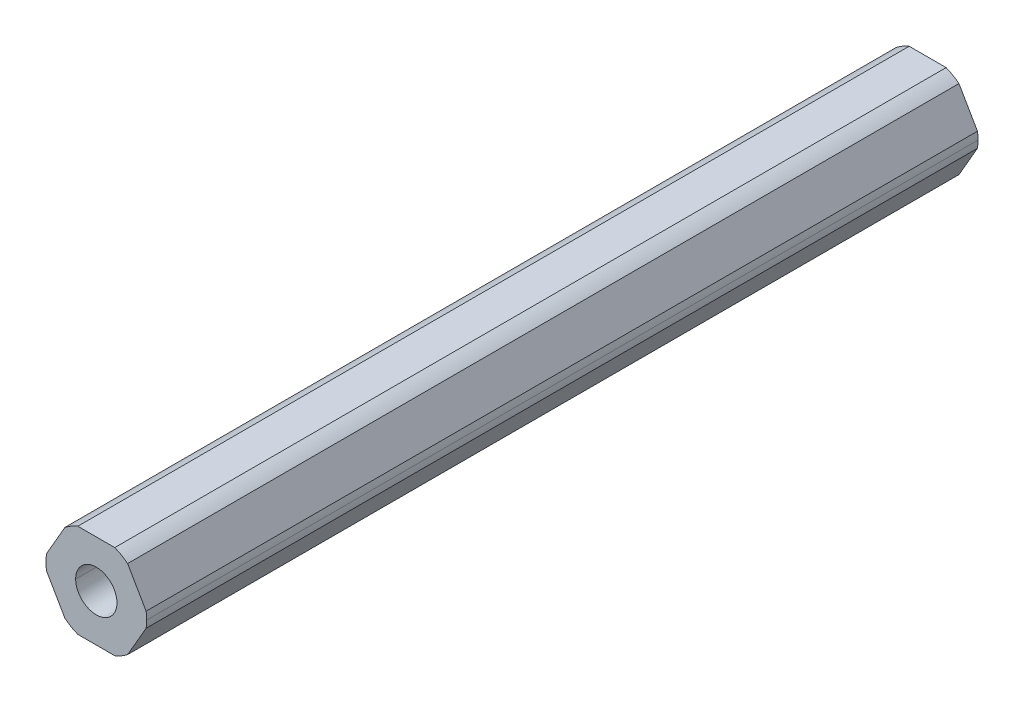
ISO-10303-21;
HEADER;
FILE_DESCRIPTION(('STEP AP214'),'2;1');
FILE_NAME('part.step','',(''),(''),'','','');
FILE_SCHEMA(('AUTOMOTIVE_DESIGN { 1 0 10303 214 1 1 1 1 }'));
ENDSEC;
DATA;
#1=APPLICATION_CONTEXT('core data for automotive mechanical design processes');
#2=APPLICATION_PROTOCOL_DEFINITION('international standard','automotive_design',2000,#1);
#3=PRODUCT_CONTEXT('',#1,'mechanical');
#4=PRODUCT('Part','Part','',(#3));
#5=PRODUCT_RELATED_PRODUCT_CATEGORY('part','',(#4));
#6=PRODUCT_DEFINITION_FORMATION('','',#4);
#7=PRODUCT_DEFINITION_CONTEXT('part definition',#1,'design');
#8=PRODUCT_DEFINITION('design','',#6,#7);
#9=PRODUCT_DEFINITION_SHAPE('','',#8);
#10=(LENGTH_UNIT() NAMED_UNIT(*) SI_UNIT(.MILLI.,.METRE.));
#11=(NAMED_UNIT(*) PLANE_ANGLE_UNIT() SI_UNIT($,.RADIAN.));
#12=(NAMED_UNIT(*) SI_UNIT($,.STERADIAN.) SOLID_ANGLE_UNIT());
#13=UNCERTAINTY_MEASURE_WITH_UNIT(LENGTH_MEASURE(1.E-05),#10,'distance_accuracy_value','');
#14=(GEOMETRIC_REPRESENTATION_CONTEXT(3) GLOBAL_UNCERTAINTY_ASSIGNED_CONTEXT((#13)) GLOBAL_UNIT_ASSIGNED_CONTEXT((#10,
#11,#12)) REPRESENTATION_CONTEXT('',''));
#15=CARTESIAN_POINT('',(0.,0.,0.));
#16=DIRECTION('',(0.,0.,1.));
#17=DIRECTION('',(1.,0.,0.));
#18=AXIS2_PLACEMENT_3D('',#15,#16,#17);
#19=CARTESIAN_POINT('',(0.,0.,-457.2));
#20=DIRECTION('',(0.,0.,1.));
#21=DIRECTION('',(1.,0.,0.));
#22=AXIS2_PLACEMENT_3D('',#19,#20,#21);
#23=CYLINDRICAL_SURFACE('',#22,2.1);
#24=DIRECTION('',(0.,0.,1.));
#25=VECTOR('',#24,1.);
#26=CARTESIAN_POINT('',(-2.1,0.,-457.2));
#27=LINE('',#26,#25);
#28=CARTESIAN_POINT('',(-2.1,0.,-457.2));
#29=VERTEX_POINT('',#28);
#30=CARTESIAN_POINT('',(-2.1,0.,-372.6764));
#31=VERTEX_POINT('',#30);
#32=EDGE_CURVE('E52',#29,#31,#27,.T.);
#33=ORIENTED_EDGE('',*,*,#32,.T.);
#34=CARTESIAN_POINT('',(0.,0.,-372.6764));
#35=DIRECTION('',(0.,0.,-1.));
#36=DIRECTION('',(-1.,0.,0.));
#37=AXIS2_PLACEMENT_3D('',#34,#35,#36);
#38=CIRCLE('',#37,2.1);
#39=CARTESIAN_POINT('',(2.1,0.,-372.6764));
#40=VERTEX_POINT('',#39);
#41=EDGE_CURVE('E66',#31,#40,#38,.F.);
#42=ORIENTED_EDGE('',*,*,#41,.T.);
#43=DIRECTION('',(0.,0.,1.));
#44=VECTOR('',#43,1.);
#45=CARTESIAN_POINT('',(2.1,0.,-457.2));
#46=LINE('',#45,#44);
#47=CARTESIAN_POINT('',(2.1,0.,-457.2));
#48=VERTEX_POINT('',#47);
#49=EDGE_CURVE('E232',#48,#40,#46,.T.);
#50=ORIENTED_EDGE('',*,*,#49,.F.);
#51=CARTESIAN_POINT('',(0.,0.,-457.2));
#52=DIRECTION('',(0.,0.,1.));
#53=DIRECTION('',(1.,0.,0.));
#54=AXIS2_PLACEMENT_3D('',#51,#52,#53);
#55=CIRCLE('',#54,2.1);
#56=EDGE_CURVE('E213',#29,#48,#55,.T.);
#57=ORIENTED_EDGE('',*,*,#56,.F.);
#58=EDGE_LOOP('',(#33,#42,#50,#57));
#59=FACE_BOUND('',#58,.T.);
#60=ADVANCED_FACE('F44',(#59),#23,.F.);
#61=CARTESIAN_POINT('',(0.,0.,-457.2));
#62=DIRECTION('',(0.,0.,1.));
#63=DIRECTION('',(1.,0.,0.));
#64=AXIS2_PLACEMENT_3D('',#61,#62,#63);
#65=CYLINDRICAL_SURFACE('',#64,5.12);
#66=CARTESIAN_POINT('',(0.,0.,-372.6764));
#67=DIRECTION('',(0.,0.,-1.));
#68=DIRECTION('',(-1.,0.,0.));
#69=AXIS2_PLACEMENT_3D('',#66,#67,#68);
#70=CIRCLE('',#69,5.12);
#71=CARTESIAN_POINT('',(5.06425896558911,-0.753446168913433,-372.6764));
#72=VERTEX_POINT('',#71);
#73=CARTESIAN_POINT('',(5.12,0.,-372.6764));
#74=VERTEX_POINT('',#73);
#75=EDGE_CURVE('E166',#72,#74,#70,.F.);
#76=ORIENTED_EDGE('',*,*,#75,.F.);
#77=DIRECTION('',(0.,0.,-1.));
#78=VECTOR('',#77,1.);
#79=CARTESIAN_POINT('',(5.06425896558911,-0.753446168913433,-457.2));
#80=LINE('',#79,#78);
#81=CARTESIAN_POINT('',(5.06425896558911,-0.753446168913433,-457.2));
#82=VERTEX_POINT('',#81);
#83=EDGE_CURVE('E179',#72,#82,#80,.T.);
#84=ORIENTED_EDGE('',*,*,#83,.T.);
#85=CARTESIAN_POINT('',(0.,0.,-457.2));
#86=DIRECTION('',(0.,0.,1.));
#87=DIRECTION('',(1.,0.,0.));
#88=AXIS2_PLACEMENT_3D('',#85,#86,#87);
#89=CIRCLE('',#88,5.12);
#90=CARTESIAN_POINT('',(5.12,0.,-457.2));
#91=VERTEX_POINT('',#90);
#92=EDGE_CURVE('E189',#82,#91,#89,.T.);
#93=ORIENTED_EDGE('',*,*,#92,.T.);
#94=DIRECTION('',(0.,0.,1.));
#95=VECTOR('',#94,1.);
#96=CARTESIAN_POINT('',(5.12,0.,-457.2));
#97=LINE('',#96,#95);
#98=EDGE_CURVE('E181',#91,#74,#97,.T.);
#99=ORIENTED_EDGE('',*,*,#98,.T.);
#100=EDGE_LOOP('',(#76,#84,#93,#99));
#101=FACE_BOUND('',#100,.T.);
#102=ADVANCED_FACE('F177',(#101),#65,.T.);
#103=CARTESIAN_POINT('',(2.74963065701564,-4.7625,457.2));
#104=DIRECTION('',(-0.866025403784442,0.5,0.));
#105=DIRECTION('',(0.,0.,1.));
#106=AXIS2_PLACEMENT_3D('',#103,#104,#105);
#107=PLANE('',#106);
#108=ORIENTED_EDGE('',*,*,#83,.F.);
#109=DIRECTION('',(0.499999999999991,0.866025403784444,0.));
#110=VECTOR('',#109,1.);
#111=CARTESIAN_POINT('',(3.18463300545771,-4.00905383108654,-372.6764));
#112=LINE('',#111,#110);
#113=CARTESIAN_POINT('',(3.18463300545771,-4.00905383108654,-372.6764));
#114=VERTEX_POINT('',#113);
#115=EDGE_CURVE('E163',#114,#72,#112,.T.);
#116=ORIENTED_EDGE('',*,*,#115,.F.);
#117=DIRECTION('',(0.,0.,1.));
#118=VECTOR('',#117,1.);
#119=CARTESIAN_POINT('',(3.1846330054577,-4.00905383108652,-457.2));
#120=LINE('',#119,#118);
#121=CARTESIAN_POINT('',(3.1846330054577,-4.00905383108652,-457.2));
#122=VERTEX_POINT('',#121);
#123=EDGE_CURVE('E218',#122,#114,#120,.T.);
#124=ORIENTED_EDGE('',*,*,#123,.F.);
#125=DIRECTION('',(0.5,0.866025403784442,0.));
#126=VECTOR('',#125,1.);
#127=CARTESIAN_POINT('',(2.74963065701564,-4.7625,-457.2));
#128=LINE('',#127,#126);
#129=EDGE_CURVE('E186',#122,#82,#128,.T.);
#130=ORIENTED_EDGE('',*,*,#129,.T.);
#131=EDGE_LOOP('',(#108,#116,#124,#130));
#132=FACE_BOUND('',#131,.T.);
#133=ADVANCED_FACE('F184',(#132),#107,.F.);
#134=CARTESIAN_POINT('',(5.49926131403117,0.,457.2));
#135=DIRECTION('',(-0.866025403784438,-0.5,0.));
#136=DIRECTION('',(-0.5,0.866025403784438,0.));
#137=AXIS2_PLACEMENT_3D('',#134,#135,#136);
#138=PLANE('',#137);
#139=DIRECTION('',(0.,0.,-1.));
#140=VECTOR('',#139,1.);
#141=CARTESIAN_POINT('',(3.18463300545762,4.00905383108658,-457.2));
#142=LINE('',#141,#140);
#143=CARTESIAN_POINT('',(3.18463300545762,4.00905383108658,-372.6764));
#144=VERTEX_POINT('',#143);
#145=CARTESIAN_POINT('',(3.18463300545762,4.00905383108658,-457.2));
#146=VERTEX_POINT('',#145);
#147=EDGE_CURVE('E222',#144,#146,#142,.T.);
#148=ORIENTED_EDGE('',*,*,#147,.F.);
#149=DIRECTION('',(-0.500000000000001,0.866025403784438,0.));
#150=VECTOR('',#149,1.);
#151=CARTESIAN_POINT('',(5.06425896558911,0.753446168913416,-372.6764));
#152=LINE('',#151,#150);
#153=CARTESIAN_POINT('',(5.06425896558911,0.753446168913416,-372.6764));
#154=VERTEX_POINT('',#153);
#155=EDGE_CURVE('E59',#154,#144,#152,.T.);
#156=ORIENTED_EDGE('',*,*,#155,.F.);
#157=DIRECTION('',(0.,0.,1.));
#158=VECTOR('',#157,1.);
#159=CARTESIAN_POINT('',(5.06425896558911,0.753446168913412,-457.2));
#160=LINE('',#159,#158);
#161=CARTESIAN_POINT('',(5.06425896558911,0.753446168913416,-457.2));
#162=VERTEX_POINT('',#161);
#163=EDGE_CURVE('E214',#162,#154,#160,.T.);
#164=ORIENTED_EDGE('',*,*,#163,.F.);
#165=DIRECTION('',(-0.5,0.866025403784438,0.));
#166=VECTOR('',#165,1.);
#167=CARTESIAN_POINT('',(5.49926131403117,0.,-457.2));
#168=LINE('',#167,#166);
#169=EDGE_CURVE('E192',#162,#146,#168,.T.);
#170=ORIENTED_EDGE('',*,*,#169,.T.);
#171=EDGE_LOOP('',(#148,#156,#164,#170));
#172=FACE_BOUND('',#171,.T.);
#173=ADVANCED_FACE('F305',(#172),#138,.F.);
#174=CARTESIAN_POINT('',(2.74963065701557,4.7625,457.2));
#175=DIRECTION('',(0.,-1.,0.));
#176=DIRECTION('',(0.,0.,-1.));
#177=AXIS2_PLACEMENT_3D('',#174,#175,#176);
#178=PLANE('',#177);
#179=DIRECTION('',(0.,0.,-1.));
#180=VECTOR('',#179,1.);
#181=CARTESIAN_POINT('',(-1.8796259601315,4.7625,-457.2));
#182=LINE('',#181,#180);
#183=CARTESIAN_POINT('',(-1.8796259601315,4.7625,-372.6764));
#184=VERTEX_POINT('',#183);
#185=CARTESIAN_POINT('',(-1.8796259601315,4.7625,-457.2));
#186=VERTEX_POINT('',#185);
#187=EDGE_CURVE('E196',#184,#186,#182,.T.);
#188=ORIENTED_EDGE('',*,*,#187,.F.);
#189=DIRECTION('',(-1.,0.,0.));
#190=VECTOR('',#189,1.);
#191=CARTESIAN_POINT('',(1.87962596013146,4.76249999999999,-372.6764));
#192=LINE('',#191,#190);
#193=CARTESIAN_POINT('',(1.87962596013146,4.76249999999999,-372.6764));
#194=VERTEX_POINT('',#193);
#195=EDGE_CURVE('E308',#194,#184,#192,.T.);
#196=ORIENTED_EDGE('',*,*,#195,.F.);
#197=DIRECTION('',(0.,0.,1.));
#198=VECTOR('',#197,1.);
#199=CARTESIAN_POINT('',(1.87962596013147,4.7625,-457.2));
#200=LINE('',#199,#198);
#201=CARTESIAN_POINT('',(1.87962596013147,4.7625,-457.2));
#202=VERTEX_POINT('',#201);
#203=EDGE_CURVE('E223',#202,#194,#200,.T.);
#204=ORIENTED_EDGE('',*,*,#203,.F.);
#205=DIRECTION('',(-1.,0.,0.));
#206=VECTOR('',#205,1.);
#207=CARTESIAN_POINT('',(2.74963065701557,4.7625,-457.2));
#208=LINE('',#207,#206);
#209=EDGE_CURVE('E202',#202,#186,#208,.T.);
#210=ORIENTED_EDGE('',*,*,#209,.T.);
#211=EDGE_LOOP('',(#188,#196,#204,#210));
#212=FACE_BOUND('',#211,.T.);
#213=ADVANCED_FACE('F348',(#212),#178,.F.);
#214=CARTESIAN_POINT('',(-2.7496306570156,4.7625,457.2));
#215=DIRECTION('',(0.866025403784442,-0.5,0.));
#216=DIRECTION('',(0.,0.,-1.));
#217=AXIS2_PLACEMENT_3D('',#214,#215,#216);
#218=PLANE('',#217);
#219=DIRECTION('',(0.,0.,-1.));
#220=VECTOR('',#219,1.);
#221=CARTESIAN_POINT('',(-5.06425896558912,0.753446168913382,-457.2));
#222=LINE('',#221,#220);
#223=CARTESIAN_POINT('',(-5.06425896558912,0.753446168913382,-372.6764));
#224=VERTEX_POINT('',#223);
#225=CARTESIAN_POINT('',(-5.06425896558912,0.753446168913382,-457.2));
#226=VERTEX_POINT('',#225);
#227=EDGE_CURVE('E204',#224,#226,#222,.T.);
#228=ORIENTED_EDGE('',*,*,#227,.F.);
#229=DIRECTION('',(-0.499999999999993,-0.866025403784443,0.));
#230=VECTOR('',#229,1.);
#231=CARTESIAN_POINT('',(-3.18463300545766,4.00905383108656,-372.6764));
#232=LINE('',#231,#230);
#233=CARTESIAN_POINT('',(-3.18463300545767,4.00905383108657,-372.6764));
#234=VERTEX_POINT('',#233);
#235=EDGE_CURVE('E320',#234,#224,#232,.T.);
#236=ORIENTED_EDGE('',*,*,#235,.F.);
#237=DIRECTION('',(0.,0.,1.));
#238=VECTOR('',#237,1.);
#239=CARTESIAN_POINT('',(-3.18463300545766,4.00905383108655,-457.2));
#240=LINE('',#239,#238);
#241=CARTESIAN_POINT('',(-3.18463300545766,4.00905383108655,-457.2));
#242=VERTEX_POINT('',#241);
#243=EDGE_CURVE('E229',#242,#234,#240,.T.);
#244=ORIENTED_EDGE('',*,*,#243,.F.);
#245=DIRECTION('',(-0.5,-0.866025403784442,0.));
#246=VECTOR('',#245,1.);
#247=CARTESIAN_POINT('',(-2.7496306570156,4.7625,-457.2));
#248=LINE('',#247,#246);
#249=EDGE_CURVE('E198',#242,#226,#248,.T.);
#250=ORIENTED_EDGE('',*,*,#249,.T.);
#251=EDGE_LOOP('',(#228,#236,#244,#250));
#252=FACE_BOUND('',#251,.T.);
#253=ADVANCED_FACE('F357',(#252),#218,.F.);
#254=CARTESIAN_POINT('',(-5.49926131403117,0.,457.2));
#255=DIRECTION('',(0.866025403784435,0.500000000000007,0.));
#256=DIRECTION('',(0.,0.,-1.));
#257=AXIS2_PLACEMENT_3D('',#254,#255,#256);
#258=PLANE('',#257);
#259=DIRECTION('',(0.,0.,-1.));
#260=VECTOR('',#259,1.);
#261=CARTESIAN_POINT('',(-3.1846330054576,-4.0090538310866,-457.2));
#262=LINE('',#261,#260);
#263=CARTESIAN_POINT('',(-3.1846330054576,-4.0090538310866,-372.6764));
#264=VERTEX_POINT('',#263);
#265=CARTESIAN_POINT('',(-3.1846330054576,-4.0090538310866,-457.2));
#266=VERTEX_POINT('',#265);
#267=EDGE_CURVE('E242',#264,#266,#262,.T.);
#268=ORIENTED_EDGE('',*,*,#267,.F.);
#269=DIRECTION('',(0.500000000000007,-0.866025403784435,0.));
#270=VECTOR('',#269,1.);
#271=CARTESIAN_POINT('',(-5.06425896558911,-0.753446168913448,-372.6764));
#272=LINE('',#271,#270);
#273=CARTESIAN_POINT('',(-5.06425896558911,-0.753446168913446,-372.6764));
#274=VERTEX_POINT('',#273);
#275=EDGE_CURVE('E316',#274,#264,#272,.T.);
#276=ORIENTED_EDGE('',*,*,#275,.F.);
#277=DIRECTION('',(0.,0.,1.));
#278=VECTOR('',#277,1.);
#279=CARTESIAN_POINT('',(-5.06425896558911,-0.75344616891345,-457.2));
#280=LINE('',#279,#278);
#281=CARTESIAN_POINT('',(-5.06425896558911,-0.75344616891345,-457.2));
#282=VERTEX_POINT('',#281);
#283=EDGE_CURVE('E255',#282,#274,#280,.T.);
#284=ORIENTED_EDGE('',*,*,#283,.F.);
#285=DIRECTION('',(0.500000000000007,-0.866025403784435,0.));
#286=VECTOR('',#285,1.);
#287=CARTESIAN_POINT('',(-5.49926131403117,0.,-457.2));
#288=LINE('',#287,#286);
#289=EDGE_CURVE('E203',#282,#266,#288,.T.);
#290=ORIENTED_EDGE('',*,*,#289,.T.);
#291=EDGE_LOOP('',(#268,#276,#284,#290));
#292=FACE_BOUND('',#291,.T.);
#293=ADVANCED_FACE('F337',(#292),#258,.F.);
#294=CARTESIAN_POINT('',(-2.74963065701554,-4.7625,457.2));
#295=DIRECTION('',(0.,1.,0.));
#296=DIRECTION('',(1.,0.,0.));
#297=AXIS2_PLACEMENT_3D('',#294,#295,#296);
#298=PLANE('',#297);
#299=DIRECTION('',(0.,0.,-1.));
#300=VECTOR('',#299,1.);
#301=CARTESIAN_POINT('',(1.87962596013154,-4.7625,-457.2));
#302=LINE('',#301,#300);
#303=CARTESIAN_POINT('',(1.87962596013153,-4.7625,-372.6764));
#304=VERTEX_POINT('',#303);
#305=CARTESIAN_POINT('',(1.87962596013154,-4.7625,-457.2));
#306=VERTEX_POINT('',#305);
#307=EDGE_CURVE('E257',#304,#306,#302,.T.);
#308=ORIENTED_EDGE('',*,*,#307,.F.);
#309=DIRECTION('',(1.,0.,0.));
#310=VECTOR('',#309,1.);
#311=CARTESIAN_POINT('',(-1.87962596013144,-4.7625,-372.6764));
#312=LINE('',#311,#310);
#313=CARTESIAN_POINT('',(-1.87962596013144,-4.7625,-372.6764));
#314=VERTEX_POINT('',#313);
#315=EDGE_CURVE('E312',#314,#304,#312,.T.);
#316=ORIENTED_EDGE('',*,*,#315,.F.);
#317=DIRECTION('',(0.,0.,1.));
#318=VECTOR('',#317,1.);
#319=CARTESIAN_POINT('',(-1.87962596013144,-4.7625,-457.2));
#320=LINE('',#319,#318);
#321=CARTESIAN_POINT('',(-1.87962596013144,-4.7625,-457.2));
#322=VERTEX_POINT('',#321);
#323=EDGE_CURVE('E206',#322,#314,#320,.T.);
#324=ORIENTED_EDGE('',*,*,#323,.F.);
#325=DIRECTION('',(1.,0.,0.));
#326=VECTOR('',#325,1.);
#327=CARTESIAN_POINT('',(-2.74963065701554,-4.7625,-457.2));
#328=LINE('',#327,#326);
#329=EDGE_CURVE('E212',#322,#306,#328,.T.);
#330=ORIENTED_EDGE('',*,*,#329,.T.);
#331=EDGE_LOOP('',(#308,#316,#324,#330));
#332=FACE_BOUND('',#331,.T.);
#333=ADVANCED_FACE('F330',(#332),#298,.F.);
#334=CARTESIAN_POINT('',(0.,0.,-457.2));
#335=DIRECTION('',(0.,0.,1.));
#336=DIRECTION('',(1.,0.,0.));
#337=AXIS2_PLACEMENT_3D('',#334,#335,#336);
#338=PLANE('',#337);
#339=CARTESIAN_POINT('',(0.,0.,-457.2));
#340=DIRECTION('',(0.,0.,1.));
#341=DIRECTION('',(1.,0.,0.));
#342=AXIS2_PLACEMENT_3D('',#339,#340,#341);
#343=CIRCLE('',#342,5.12);
#344=EDGE_CURVE('E219',#146,#202,#343,.T.);
#345=ORIENTED_EDGE('',*,*,#344,.F.);
#346=ORIENTED_EDGE('',*,*,#169,.F.);
#347=CARTESIAN_POINT('',(0.,0.,-457.2));
#348=DIRECTION('',(0.,0.,1.));
#349=DIRECTION('',(1.,0.,0.));
#350=AXIS2_PLACEMENT_3D('',#347,#348,#349);
#351=CIRCLE('',#350,5.12);
#352=EDGE_CURVE('E217',#91,#162,#351,.T.);
#353=ORIENTED_EDGE('',*,*,#352,.F.);
#354=ORIENTED_EDGE('',*,*,#92,.F.);
#355=ORIENTED_EDGE('',*,*,#129,.F.);
#356=CARTESIAN_POINT('',(0.,0.,-457.2));
#357=DIRECTION('',(0.,0.,1.));
#358=DIRECTION('',(1.,0.,0.));
#359=AXIS2_PLACEMENT_3D('',#356,#357,#358);
#360=CIRCLE('',#359,5.12);
#361=EDGE_CURVE('E243',#306,#122,#360,.T.);
#362=ORIENTED_EDGE('',*,*,#361,.F.);
#363=ORIENTED_EDGE('',*,*,#329,.F.);
#364=CARTESIAN_POINT('',(0.,0.,-457.2));
#365=DIRECTION('',(0.,0.,1.));
#366=DIRECTION('',(1.,0.,0.));
#367=AXIS2_PLACEMENT_3D('',#364,#365,#366);
#368=CIRCLE('',#367,5.12);
#369=EDGE_CURVE('E244',#266,#322,#368,.T.);
#370=ORIENTED_EDGE('',*,*,#369,.F.);
#371=ORIENTED_EDGE('',*,*,#289,.F.);
#372=CARTESIAN_POINT('',(0.,0.,-457.2));
#373=DIRECTION('',(0.,0.,1.));
#374=DIRECTION('',(1.,0.,0.));
#375=AXIS2_PLACEMENT_3D('',#372,#373,#374);
#376=CIRCLE('',#375,5.12);
#377=EDGE_CURVE('E207',#226,#282,#376,.T.);
#378=ORIENTED_EDGE('',*,*,#377,.F.);
#379=ORIENTED_EDGE('',*,*,#249,.F.);
#380=CARTESIAN_POINT('',(0.,0.,-457.2));
#381=DIRECTION('',(0.,0.,1.));
#382=DIRECTION('',(1.,0.,0.));
#383=AXIS2_PLACEMENT_3D('',#380,#381,#382);
#384=CIRCLE('',#383,5.12);
#385=EDGE_CURVE('E249',#186,#242,#384,.T.);
#386=ORIENTED_EDGE('',*,*,#385,.F.);
#387=ORIENTED_EDGE('',*,*,#209,.F.);
#388=EDGE_LOOP('',(#345,#346,#353,#354,#355,#362,#363,#370,#371,#378,#379,#386,#387));
#389=FACE_BOUND('',#388,.T.);
#390=CARTESIAN_POINT('',(0.,0.,-457.2));
#391=DIRECTION('',(0.,0.,1.));
#392=DIRECTION('',(1.,0.,0.));
#393=AXIS2_PLACEMENT_3D('',#390,#391,#392);
#394=CIRCLE('',#393,2.1);
#395=EDGE_CURVE('E208',#48,#29,#394,.T.);
#396=ORIENTED_EDGE('',*,*,#395,.T.);
#397=ORIENTED_EDGE('',*,*,#56,.T.);
#398=EDGE_LOOP('',(#396,#397));
#399=FACE_BOUND('',#398,.T.);
#400=ADVANCED_FACE('F46',(#389,#399),#338,.F.);
#401=CARTESIAN_POINT('',(0.,0.,-457.2));
#402=DIRECTION('',(0.,0.,1.));
#403=DIRECTION('',(1.,0.,0.));
#404=AXIS2_PLACEMENT_3D('',#401,#402,#403);
#405=CYLINDRICAL_SURFACE('',#404,5.12);
#406=EDGE_CURVE('E173',#74,#154,#70,.F.);
#407=ORIENTED_EDGE('',*,*,#406,.F.);
#408=ORIENTED_EDGE('',*,*,#98,.F.);
#409=ORIENTED_EDGE('',*,*,#352,.T.);
#410=ORIENTED_EDGE('',*,*,#163,.T.);
#411=EDGE_LOOP('',(#407,#408,#409,#410));
#412=FACE_BOUND('',#411,.T.);
#413=ADVANCED_FACE('F295',(#412),#405,.T.);
#414=CARTESIAN_POINT('',(0.,0.,-457.2));
#415=DIRECTION('',(0.,0.,1.));
#416=DIRECTION('',(1.,0.,0.));
#417=AXIS2_PLACEMENT_3D('',#414,#415,#416);
#418=CYLINDRICAL_SURFACE('',#417,5.12);
#419=CARTESIAN_POINT('',(0.,0.,-372.6764));
#420=DIRECTION('',(0.,0.,-1.));
#421=DIRECTION('',(-1.,0.,0.));
#422=AXIS2_PLACEMENT_3D('',#419,#420,#421);
#423=CIRCLE('',#422,5.12000000000003);
#424=EDGE_CURVE('E169',#304,#114,#423,.F.);
#425=ORIENTED_EDGE('',*,*,#424,.F.);
#426=ORIENTED_EDGE('',*,*,#307,.T.);
#427=ORIENTED_EDGE('',*,*,#361,.T.);
#428=ORIENTED_EDGE('',*,*,#123,.T.);
#429=EDGE_LOOP('',(#425,#426,#427,#428));
#430=FACE_BOUND('',#429,.T.);
#431=ADVANCED_FACE('F335',(#430),#418,.T.);
#432=CARTESIAN_POINT('',(0.,0.,-457.2));
#433=DIRECTION('',(0.,0.,1.));
#434=DIRECTION('',(1.,0.,0.));
#435=AXIS2_PLACEMENT_3D('',#432,#433,#434);
#436=CYLINDRICAL_SURFACE('',#435,5.12);
#437=CARTESIAN_POINT('',(0.,0.,-372.6764));
#438=DIRECTION('',(0.,0.,-1.));
#439=DIRECTION('',(-1.,0.,0.));
#440=AXIS2_PLACEMENT_3D('',#437,#438,#439);
#441=CIRCLE('',#440,5.12);
#442=EDGE_CURVE('E314',#264,#314,#441,.F.);
#443=ORIENTED_EDGE('',*,*,#442,.F.);
#444=ORIENTED_EDGE('',*,*,#267,.T.);
#445=ORIENTED_EDGE('',*,*,#369,.T.);
#446=ORIENTED_EDGE('',*,*,#323,.T.);
#447=EDGE_LOOP('',(#443,#444,#445,#446));
#448=FACE_BOUND('',#447,.T.);
#449=ADVANCED_FACE('F364',(#448),#436,.T.);
#450=CARTESIAN_POINT('',(0.,0.,-457.2));
#451=DIRECTION('',(0.,0.,1.));
#452=DIRECTION('',(1.,0.,0.));
#453=AXIS2_PLACEMENT_3D('',#450,#451,#452);
#454=CYLINDRICAL_SURFACE('',#453,5.12);
#455=CARTESIAN_POINT('',(0.,0.,-372.6764));
#456=DIRECTION('',(0.,0.,-1.));
#457=DIRECTION('',(-1.,0.,0.));
#458=AXIS2_PLACEMENT_3D('',#455,#456,#457);
#459=CIRCLE('',#458,5.12);
#460=EDGE_CURVE('E318',#224,#274,#459,.F.);
#461=ORIENTED_EDGE('',*,*,#460,.F.);
#462=ORIENTED_EDGE('',*,*,#227,.T.);
#463=ORIENTED_EDGE('',*,*,#377,.T.);
#464=ORIENTED_EDGE('',*,*,#283,.T.);
#465=EDGE_LOOP('',(#461,#462,#463,#464));
#466=FACE_BOUND('',#465,.T.);
#467=ADVANCED_FACE('F352',(#466),#454,.T.);
#468=CARTESIAN_POINT('',(0.,0.,-457.2));
#469=DIRECTION('',(0.,0.,1.));
#470=DIRECTION('',(1.,0.,0.));
#471=AXIS2_PLACEMENT_3D('',#468,#469,#470);
#472=CYLINDRICAL_SURFACE('',#471,5.12);
#473=CARTESIAN_POINT('',(0.,0.,-372.6764));
#474=DIRECTION('',(0.,0.,-1.));
#475=DIRECTION('',(-1.,0.,0.));
#476=AXIS2_PLACEMENT_3D('',#473,#474,#475);
#477=CIRCLE('',#476,5.12000000000002);
#478=EDGE_CURVE('E322',#184,#234,#477,.F.);
#479=ORIENTED_EDGE('',*,*,#478,.F.);
#480=ORIENTED_EDGE('',*,*,#187,.T.);
#481=ORIENTED_EDGE('',*,*,#385,.T.);
#482=ORIENTED_EDGE('',*,*,#243,.T.);
#483=EDGE_LOOP('',(#479,#480,#481,#482));
#484=FACE_BOUND('',#483,.T.);
#485=ADVANCED_FACE('F349',(#484),#472,.T.);
#486=CARTESIAN_POINT('',(0.,0.,-457.2));
#487=DIRECTION('',(0.,0.,1.));
#488=DIRECTION('',(1.,0.,0.));
#489=AXIS2_PLACEMENT_3D('',#486,#487,#488);
#490=CYLINDRICAL_SURFACE('',#489,5.12);
#491=CARTESIAN_POINT('',(0.,0.,-372.6764));
#492=DIRECTION('',(0.,0.,-1.));
#493=DIRECTION('',(-1.,0.,0.));
#494=AXIS2_PLACEMENT_3D('',#491,#492,#493);
#495=CIRCLE('',#494,5.12);
#496=EDGE_CURVE('E306',#144,#194,#495,.F.);
#497=ORIENTED_EDGE('',*,*,#496,.F.);
#498=ORIENTED_EDGE('',*,*,#147,.T.);
#499=ORIENTED_EDGE('',*,*,#344,.T.);
#500=ORIENTED_EDGE('',*,*,#203,.T.);
#501=EDGE_LOOP('',(#497,#498,#499,#500));
#502=FACE_BOUND('',#501,.T.);
#503=ADVANCED_FACE('F351',(#502),#490,.T.);
#504=CARTESIAN_POINT('',(0.,0.,-457.2));
#505=DIRECTION('',(0.,0.,1.));
#506=DIRECTION('',(1.,0.,0.));
#507=AXIS2_PLACEMENT_3D('',#504,#505,#506);
#508=CYLINDRICAL_SURFACE('',#507,2.1);
#509=ORIENTED_EDGE('',*,*,#49,.T.);
#510=CARTESIAN_POINT('',(0.,0.,-372.6764));
#511=DIRECTION('',(0.,0.,-1.));
#512=DIRECTION('',(-1.,0.,0.));
#513=AXIS2_PLACEMENT_3D('',#510,#511,#512);
#514=CIRCLE('',#513,2.1);
#515=EDGE_CURVE('E11',#40,#31,#514,.F.);
#516=ORIENTED_EDGE('',*,*,#515,.T.);
#517=ORIENTED_EDGE('',*,*,#32,.F.);
#518=ORIENTED_EDGE('',*,*,#395,.F.);
#519=EDGE_LOOP('',(#509,#516,#517,#518));
#520=FACE_BOUND('',#519,.T.);
#521=ADVANCED_FACE('F328',(#520),#508,.F.);
#522=CARTESIAN_POINT('',(42.4141923945524,-67.0339326119799,-372.6764));
#523=DIRECTION('',(0.,0.,-1.));
#524=DIRECTION('',(0.96021721826506,0.279254174091113,0.));
#525=AXIS2_PLACEMENT_3D('',#522,#523,#524);
#526=PLANE('',#525);
#527=ORIENTED_EDGE('',*,*,#75,.T.);
#528=ORIENTED_EDGE('',*,*,#406,.T.);
#529=ORIENTED_EDGE('',*,*,#155,.T.);
#530=ORIENTED_EDGE('',*,*,#496,.T.);
#531=ORIENTED_EDGE('',*,*,#195,.T.);
#532=ORIENTED_EDGE('',*,*,#478,.T.);
#533=ORIENTED_EDGE('',*,*,#235,.T.);
#534=ORIENTED_EDGE('',*,*,#460,.T.);
#535=ORIENTED_EDGE('',*,*,#275,.T.);
#536=ORIENTED_EDGE('',*,*,#442,.T.);
#537=ORIENTED_EDGE('',*,*,#315,.T.);
#538=ORIENTED_EDGE('',*,*,#424,.T.);
#539=ORIENTED_EDGE('',*,*,#115,.T.);
#540=EDGE_LOOP('',(#527,#528,#529,#530,#531,#532,#533,#534,#535,#536,#537,#538,#539));
#541=FACE_BOUND('',#540,.T.);
#542=ORIENTED_EDGE('',*,*,#515,.F.);
#543=ORIENTED_EDGE('',*,*,#41,.F.);
#544=EDGE_LOOP('',(#542,#543));
#545=FACE_BOUND('',#544,.T.);
#546=ADVANCED_FACE('F165',(#541,#545),#526,.F.);
#547=CLOSED_SHELL('',(#60,#102,#133,#173,#213,#253,#293,#333,#400,#413,#431,#449,#467,#485,#503,
#521,#546));
#548=MANIFOLD_SOLID_BREP('B2',#547);
#549=ADVANCED_BREP_SHAPE_REPRESENTATION('',(#18,#548),#14);
#550=SHAPE_DEFINITION_REPRESENTATION(#9,#549);
ENDSEC;
END-ISO-10303-21;
